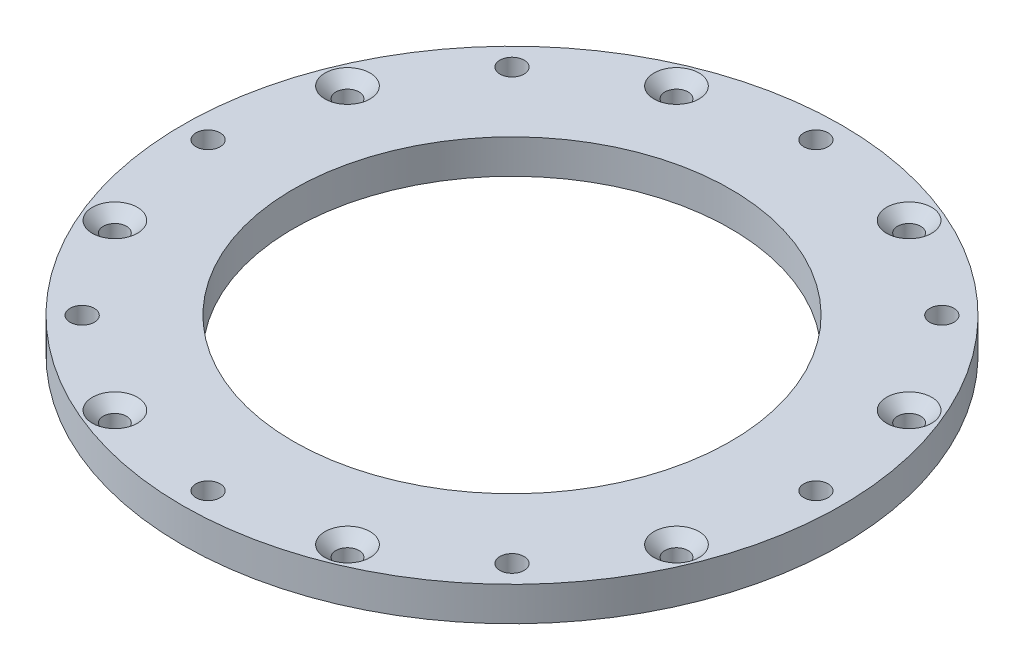
ISO-10303-21;
HEADER;
FILE_DESCRIPTION(('STEP AP214'),'2;1');
FILE_NAME('part.step','',(''),(''),'','','');
FILE_SCHEMA(('AUTOMOTIVE_DESIGN { 1 0 10303 214 1 1 1 1 }'));
ENDSEC;
DATA;
#1=APPLICATION_CONTEXT('core data for automotive mechanical design processes');
#2=APPLICATION_PROTOCOL_DEFINITION('international standard','automotive_design',2000,#1);
#3=PRODUCT_CONTEXT('',#1,'mechanical');
#4=PRODUCT('Part','Part','',(#3));
#5=PRODUCT_RELATED_PRODUCT_CATEGORY('part','',(#4));
#6=PRODUCT_DEFINITION_FORMATION('','',#4);
#7=PRODUCT_DEFINITION_CONTEXT('part definition',#1,'design');
#8=PRODUCT_DEFINITION('design','',#6,#7);
#9=PRODUCT_DEFINITION_SHAPE('','',#8);
#10=(LENGTH_UNIT() NAMED_UNIT(*) SI_UNIT(.MILLI.,.METRE.));
#11=(NAMED_UNIT(*) PLANE_ANGLE_UNIT() SI_UNIT($,.RADIAN.));
#12=(NAMED_UNIT(*) SI_UNIT($,.STERADIAN.) SOLID_ANGLE_UNIT());
#13=UNCERTAINTY_MEASURE_WITH_UNIT(LENGTH_MEASURE(1.E-05),#10,'distance_accuracy_value','');
#14=(GEOMETRIC_REPRESENTATION_CONTEXT(3) GLOBAL_UNCERTAINTY_ASSIGNED_CONTEXT((#13)) GLOBAL_UNIT_ASSIGNED_CONTEXT((#10,
#11,#12)) REPRESENTATION_CONTEXT('',''));
#15=CARTESIAN_POINT('',(0.,0.,0.));
#16=DIRECTION('',(0.,0.,1.));
#17=DIRECTION('',(1.,0.,0.));
#18=AXIS2_PLACEMENT_3D('',#15,#16,#17);
#19=CARTESIAN_POINT('',(0.,5.,0.));
#20=DIRECTION('',(0.,1.,0.));
#21=DIRECTION('',(0.,0.,1.));
#22=AXIS2_PLACEMENT_3D('',#19,#20,#21);
#23=PLANE('',#22);
#24=CARTESIAN_POINT('',(87.9705872597535,5.,-41.1126391967523));
#25=DIRECTION('',(0.,1.,0.));
#26=DIRECTION('',(0.,0.,1.));
#27=AXIS2_PLACEMENT_3D('',#24,#25,#26);
#28=CIRCLE('',#27,3.3);
#29=CARTESIAN_POINT('',(87.9705872597535,5.,-37.8126391967523));
#30=VERTEX_POINT('',#29);
#31=EDGE_CURVE('E224',#30,#30,#28,.T.);
#32=ORIENTED_EDGE('',*,*,#31,.F.);
#33=EDGE_LOOP('',(#32));
#34=FACE_BOUND('',#33,.T.);
#35=CARTESIAN_POINT('',(122.029412740246,5.,-41.1126391967522));
#36=DIRECTION('',(0.,1.,0.));
#37=DIRECTION('',(0.,0.,1.));
#38=AXIS2_PLACEMENT_3D('',#35,#36,#37);
#39=CIRCLE('',#38,3.3);
#40=CARTESIAN_POINT('',(122.029412740246,5.,-37.8126391967523));
#41=VERTEX_POINT('',#40);
#42=EDGE_CURVE('E212',#41,#41,#39,.T.);
#43=ORIENTED_EDGE('',*,*,#42,.F.);
#44=EDGE_LOOP('',(#43));
#45=FACE_BOUND('',#44,.T.);
#46=CARTESIAN_POINT('',(146.112639196752,5.,-17.0294127402465));
#47=DIRECTION('',(0.,1.,0.));
#48=DIRECTION('',(0.,0.,1.));
#49=AXIS2_PLACEMENT_3D('',#46,#47,#48);
#50=CIRCLE('',#49,3.3);
#51=CARTESIAN_POINT('',(146.112639196752,5.,-13.7294127402465));
#52=VERTEX_POINT('',#51);
#53=EDGE_CURVE('E200',#52,#52,#50,.T.);
#54=ORIENTED_EDGE('',*,*,#53,.F.);
#55=EDGE_LOOP('',(#54));
#56=FACE_BOUND('',#55,.T.);
#57=CARTESIAN_POINT('',(146.112639196752,5.,17.0294127402465));
#58=DIRECTION('',(0.,1.,0.));
#59=DIRECTION('',(0.,0.,1.));
#60=AXIS2_PLACEMENT_3D('',#57,#58,#59);
#61=CIRCLE('',#60,3.3);
#62=CARTESIAN_POINT('',(146.112639196752,5.,20.3294127402465));
#63=VERTEX_POINT('',#62);
#64=EDGE_CURVE('E188',#63,#63,#61,.T.);
#65=ORIENTED_EDGE('',*,*,#64,.F.);
#66=EDGE_LOOP('',(#65));
#67=FACE_BOUND('',#66,.T.);
#68=CARTESIAN_POINT('',(122.029412740246,5.,41.1126391967523));
#69=DIRECTION('',(0.,1.,0.));
#70=DIRECTION('',(0.,0.,1.));
#71=AXIS2_PLACEMENT_3D('',#68,#69,#70);
#72=CIRCLE('',#71,3.30000000000001);
#73=CARTESIAN_POINT('',(122.029412740246,5.,44.4126391967523));
#74=VERTEX_POINT('',#73);
#75=EDGE_CURVE('E176',#74,#74,#72,.T.);
#76=ORIENTED_EDGE('',*,*,#75,.F.);
#77=EDGE_LOOP('',(#76));
#78=FACE_BOUND('',#77,.T.);
#79=CARTESIAN_POINT('',(87.9705872597534,5.,41.1126391967523));
#80=DIRECTION('',(0.,1.,0.));
#81=DIRECTION('',(0.,0.,1.));
#82=AXIS2_PLACEMENT_3D('',#79,#80,#81);
#83=CIRCLE('',#82,3.3);
#84=CARTESIAN_POINT('',(87.9705872597534,5.,44.4126391967523));
#85=VERTEX_POINT('',#84);
#86=EDGE_CURVE('E164',#85,#85,#83,.T.);
#87=ORIENTED_EDGE('',*,*,#86,.F.);
#88=EDGE_LOOP('',(#87));
#89=FACE_BOUND('',#88,.T.);
#90=CARTESIAN_POINT('',(63.8873608032477,5.,17.0294127402465));
#91=DIRECTION('',(0.,1.,0.));
#92=DIRECTION('',(0.,0.,1.));
#93=AXIS2_PLACEMENT_3D('',#90,#91,#92);
#94=CIRCLE('',#93,3.3);
#95=CARTESIAN_POINT('',(63.8873608032477,5.,20.3294127402465));
#96=VERTEX_POINT('',#95);
#97=EDGE_CURVE('E152',#96,#96,#94,.T.);
#98=ORIENTED_EDGE('',*,*,#97,.F.);
#99=EDGE_LOOP('',(#98));
#100=FACE_BOUND('',#99,.T.);
#101=CARTESIAN_POINT('',(63.8873608032477,5.,-17.0294127402465));
#102=DIRECTION('',(0.,1.,0.));
#103=DIRECTION('',(0.,0.,1.));
#104=AXIS2_PLACEMENT_3D('',#101,#102,#103);
#105=CIRCLE('',#104,3.3);
#106=CARTESIAN_POINT('',(63.8873608032477,5.,-13.7294127402465));
#107=VERTEX_POINT('',#106);
#108=EDGE_CURVE('E140',#107,#107,#105,.T.);
#109=ORIENTED_EDGE('',*,*,#108,.F.);
#110=EDGE_LOOP('',(#109));
#111=FACE_BOUND('',#110,.T.);
#112=CARTESIAN_POINT('',(105.,5.,-44.5));
#113=DIRECTION('',(0.,1.,0.));
#114=DIRECTION('',(0.,0.,1.));
#115=AXIS2_PLACEMENT_3D('',#112,#113,#114);
#116=CIRCLE('',#115,1.77499999999998);
#117=CARTESIAN_POINT('',(105.,5.,-42.725));
#118=VERTEX_POINT('',#117);
#119=EDGE_CURVE('E73',#118,#118,#116,.T.);
#120=ORIENTED_EDGE('',*,*,#119,.F.);
#121=EDGE_LOOP('',(#120));
#122=FACE_BOUND('',#121,.T.);
#123=CARTESIAN_POINT('',(136.466251762801,5.,-31.4662517628014));
#124=DIRECTION('',(0.,1.,0.));
#125=DIRECTION('',(0.,0.,1.));
#126=AXIS2_PLACEMENT_3D('',#123,#124,#125);
#127=CIRCLE('',#126,1.77499999999999);
#128=CARTESIAN_POINT('',(136.466251762801,5.,-29.6912517628014));
#129=VERTEX_POINT('',#128);
#130=EDGE_CURVE('E98',#129,#129,#127,.T.);
#131=ORIENTED_EDGE('',*,*,#130,.F.);
#132=EDGE_LOOP('',(#131));
#133=FACE_BOUND('',#132,.T.);
#134=CARTESIAN_POINT('',(136.466251762801,5.,31.4662517628014));
#135=DIRECTION('',(0.,1.,0.));
#136=DIRECTION('',(0.,0.,1.));
#137=AXIS2_PLACEMENT_3D('',#134,#135,#136);
#138=CIRCLE('',#137,1.77499999999999);
#139=CARTESIAN_POINT('',(136.466251762801,5.,33.2412517628014));
#140=VERTEX_POINT('',#139);
#141=EDGE_CURVE('E90',#140,#140,#138,.T.);
#142=ORIENTED_EDGE('',*,*,#141,.F.);
#143=EDGE_LOOP('',(#142));
#144=FACE_BOUND('',#143,.T.);
#145=CARTESIAN_POINT('',(73.5337482371986,5.,31.4662517628014));
#146=DIRECTION('',(0.,1.,0.));
#147=DIRECTION('',(0.,0.,1.));
#148=AXIS2_PLACEMENT_3D('',#145,#146,#147);
#149=CIRCLE('',#148,1.77500000000001);
#150=CARTESIAN_POINT('',(73.5337482371986,5.,33.2412517628014));
#151=VERTEX_POINT('',#150);
#152=EDGE_CURVE('E81',#151,#151,#149,.T.);
#153=ORIENTED_EDGE('',*,*,#152,.F.);
#154=EDGE_LOOP('',(#153));
#155=FACE_BOUND('',#154,.T.);
#156=CARTESIAN_POINT('',(60.4999999999999,5.,0.));
#157=DIRECTION('',(0.,1.,0.));
#158=DIRECTION('',(0.,0.,1.));
#159=AXIS2_PLACEMENT_3D('',#156,#157,#158);
#160=CIRCLE('',#159,1.775);
#161=CARTESIAN_POINT('',(60.4999999999999,5.,1.77500000000001));
#162=VERTEX_POINT('',#161);
#163=EDGE_CURVE('E82',#162,#162,#160,.T.);
#164=ORIENTED_EDGE('',*,*,#163,.F.);
#165=EDGE_LOOP('',(#164));
#166=FACE_BOUND('',#165,.T.);
#167=CARTESIAN_POINT('',(149.5,5.,0.));
#168=DIRECTION('',(0.,1.,0.));
#169=DIRECTION('',(0.,0.,1.));
#170=AXIS2_PLACEMENT_3D('',#167,#168,#169);
#171=CIRCLE('',#170,1.775);
#172=CARTESIAN_POINT('',(149.5,5.,1.775));
#173=VERTEX_POINT('',#172);
#174=EDGE_CURVE('E122',#173,#173,#171,.T.);
#175=ORIENTED_EDGE('',*,*,#174,.F.);
#176=EDGE_LOOP('',(#175));
#177=FACE_BOUND('',#176,.T.);
#178=CARTESIAN_POINT('',(105.,5.,44.5));
#179=DIRECTION('',(0.,1.,0.));
#180=DIRECTION('',(0.,0.,1.));
#181=AXIS2_PLACEMENT_3D('',#178,#179,#180);
#182=CIRCLE('',#181,1.77499999999999);
#183=CARTESIAN_POINT('',(105.,5.,46.275));
#184=VERTEX_POINT('',#183);
#185=EDGE_CURVE('E113',#184,#184,#182,.T.);
#186=ORIENTED_EDGE('',*,*,#185,.F.);
#187=EDGE_LOOP('',(#186));
#188=FACE_BOUND('',#187,.T.);
#189=CARTESIAN_POINT('',(73.5337482371986,5.,-31.4662517628014));
#190=DIRECTION('',(0.,1.,0.));
#191=DIRECTION('',(0.,0.,1.));
#192=AXIS2_PLACEMENT_3D('',#189,#190,#191);
#193=CIRCLE('',#192,1.77499999999999);
#194=CARTESIAN_POINT('',(73.5337482371986,5.,-29.6912517628014));
#195=VERTEX_POINT('',#194);
#196=EDGE_CURVE('E69',#195,#195,#193,.T.);
#197=ORIENTED_EDGE('',*,*,#196,.F.);
#198=EDGE_LOOP('',(#197));
#199=FACE_BOUND('',#198,.T.);
#200=CARTESIAN_POINT('',(105.,5.,0.));
#201=DIRECTION('',(0.,1.,0.));
#202=DIRECTION('',(0.,0.,1.));
#203=AXIS2_PLACEMENT_3D('',#200,#201,#202);
#204=CIRCLE('',#203,32.);
#205=CARTESIAN_POINT('',(105.,5.,32.));
#206=VERTEX_POINT('',#205);
#207=EDGE_CURVE('E62',#206,#206,#204,.T.);
#208=ORIENTED_EDGE('',*,*,#207,.F.);
#209=EDGE_LOOP('',(#208));
#210=FACE_BOUND('',#209,.T.);
#211=CARTESIAN_POINT('',(105.,5.,0.));
#212=DIRECTION('',(0.,1.,0.));
#213=DIRECTION('',(0.,0.,1.));
#214=AXIS2_PLACEMENT_3D('',#211,#212,#213);
#215=CIRCLE('',#214,48.25);
#216=CARTESIAN_POINT('',(105.,5.,48.25));
#217=VERTEX_POINT('',#216);
#218=EDGE_CURVE('E52',#217,#217,#215,.T.);
#219=ORIENTED_EDGE('',*,*,#218,.T.);
#220=EDGE_LOOP('',(#219));
#221=FACE_BOUND('',#220,.T.);
#222=ADVANCED_FACE('F44',(#34,#45,#56,#67,#78,#89,#100,#111,#122,#133,#144,#155,#166,#177,#188,
#199,#210,#221),#23,.T.);
#223=CARTESIAN_POINT('',(0.,0.,0.));
#224=DIRECTION('',(0.,1.,0.));
#225=DIRECTION('',(0.,0.,1.));
#226=AXIS2_PLACEMENT_3D('',#223,#224,#225);
#227=PLANE('',#226);
#228=CARTESIAN_POINT('',(87.9705872597535,0.,-41.1126391967523));
#229=DIRECTION('',(0.,1.,0.));
#230=DIRECTION('',(0.,0.,1.));
#231=AXIS2_PLACEMENT_3D('',#228,#229,#230);
#232=CIRCLE('',#231,1.69999999999999);
#233=CARTESIAN_POINT('',(87.9705872597535,0.,-39.4126391967523));
#234=VERTEX_POINT('',#233);
#235=EDGE_CURVE('E216',#234,#234,#232,.T.);
#236=ORIENTED_EDGE('',*,*,#235,.T.);
#237=EDGE_LOOP('',(#236));
#238=FACE_BOUND('',#237,.T.);
#239=CARTESIAN_POINT('',(122.029412740246,0.,-41.1126391967522));
#240=DIRECTION('',(0.,1.,0.));
#241=DIRECTION('',(0.,0.,1.));
#242=AXIS2_PLACEMENT_3D('',#239,#240,#241);
#243=CIRCLE('',#242,1.69999999999999);
#244=CARTESIAN_POINT('',(122.029412740246,0.,-39.4126391967523));
#245=VERTEX_POINT('',#244);
#246=EDGE_CURVE('E204',#245,#245,#243,.T.);
#247=ORIENTED_EDGE('',*,*,#246,.T.);
#248=EDGE_LOOP('',(#247));
#249=FACE_BOUND('',#248,.T.);
#250=CARTESIAN_POINT('',(146.112639196752,0.,-17.0294127402465));
#251=DIRECTION('',(0.,1.,0.));
#252=DIRECTION('',(0.,0.,1.));
#253=AXIS2_PLACEMENT_3D('',#250,#251,#252);
#254=CIRCLE('',#253,1.69999999999998);
#255=CARTESIAN_POINT('',(146.112639196752,0.,-15.3294127402465));
#256=VERTEX_POINT('',#255);
#257=EDGE_CURVE('E192',#256,#256,#254,.T.);
#258=ORIENTED_EDGE('',*,*,#257,.T.);
#259=EDGE_LOOP('',(#258));
#260=FACE_BOUND('',#259,.T.);
#261=CARTESIAN_POINT('',(146.112639196752,0.,17.0294127402465));
#262=DIRECTION('',(0.,1.,0.));
#263=DIRECTION('',(0.,0.,1.));
#264=AXIS2_PLACEMENT_3D('',#261,#262,#263);
#265=CIRCLE('',#264,1.69999999999998);
#266=CARTESIAN_POINT('',(146.112639196752,0.,18.7294127402465));
#267=VERTEX_POINT('',#266);
#268=EDGE_CURVE('E180',#267,#267,#265,.T.);
#269=ORIENTED_EDGE('',*,*,#268,.T.);
#270=EDGE_LOOP('',(#269));
#271=FACE_BOUND('',#270,.T.);
#272=CARTESIAN_POINT('',(122.029412740246,0.,41.1126391967523));
#273=DIRECTION('',(0.,1.,0.));
#274=DIRECTION('',(0.,0.,1.));
#275=AXIS2_PLACEMENT_3D('',#272,#273,#274);
#276=CIRCLE('',#275,1.69999999999999);
#277=CARTESIAN_POINT('',(122.029412740246,0.,42.8126391967523));
#278=VERTEX_POINT('',#277);
#279=EDGE_CURVE('E168',#278,#278,#276,.T.);
#280=ORIENTED_EDGE('',*,*,#279,.T.);
#281=EDGE_LOOP('',(#280));
#282=FACE_BOUND('',#281,.T.);
#283=CARTESIAN_POINT('',(87.9705872597534,0.,41.1126391967523));
#284=DIRECTION('',(0.,1.,0.));
#285=DIRECTION('',(0.,0.,1.));
#286=AXIS2_PLACEMENT_3D('',#283,#284,#285);
#287=CIRCLE('',#286,1.69999999999999);
#288=CARTESIAN_POINT('',(87.9705872597534,0.,42.8126391967522));
#289=VERTEX_POINT('',#288);
#290=EDGE_CURVE('E156',#289,#289,#287,.T.);
#291=ORIENTED_EDGE('',*,*,#290,.T.);
#292=EDGE_LOOP('',(#291));
#293=FACE_BOUND('',#292,.T.);
#294=CARTESIAN_POINT('',(63.8873608032477,0.,17.0294127402465));
#295=DIRECTION('',(0.,1.,0.));
#296=DIRECTION('',(0.,0.,1.));
#297=AXIS2_PLACEMENT_3D('',#294,#295,#296);
#298=CIRCLE('',#297,1.69999999999999);
#299=CARTESIAN_POINT('',(63.8873608032477,0.,18.7294127402465));
#300=VERTEX_POINT('',#299);
#301=EDGE_CURVE('E144',#300,#300,#298,.T.);
#302=ORIENTED_EDGE('',*,*,#301,.T.);
#303=EDGE_LOOP('',(#302));
#304=FACE_BOUND('',#303,.T.);
#305=CARTESIAN_POINT('',(63.8873608032477,0.,-17.0294127402465));
#306=DIRECTION('',(0.,1.,0.));
#307=DIRECTION('',(0.,0.,1.));
#308=AXIS2_PLACEMENT_3D('',#305,#306,#307);
#309=CIRCLE('',#308,1.69999999999999);
#310=CARTESIAN_POINT('',(63.8873608032477,0.,-15.3294127402465));
#311=VERTEX_POINT('',#310);
#312=EDGE_CURVE('E114',#311,#311,#309,.T.);
#313=ORIENTED_EDGE('',*,*,#312,.T.);
#314=EDGE_LOOP('',(#313));
#315=FACE_BOUND('',#314,.T.);
#316=CARTESIAN_POINT('',(105.,0.,-44.5));
#317=DIRECTION('',(0.,1.,0.));
#318=DIRECTION('',(0.,0.,1.));
#319=AXIS2_PLACEMENT_3D('',#316,#317,#318);
#320=CIRCLE('',#319,1.77499999999998);
#321=CARTESIAN_POINT('',(105.,0.,-42.725));
#322=VERTEX_POINT('',#321);
#323=EDGE_CURVE('E102',#322,#322,#320,.T.);
#324=ORIENTED_EDGE('',*,*,#323,.T.);
#325=EDGE_LOOP('',(#324));
#326=FACE_BOUND('',#325,.T.);
#327=CARTESIAN_POINT('',(136.466251762801,0.,-31.4662517628014));
#328=DIRECTION('',(0.,1.,0.));
#329=DIRECTION('',(0.,0.,1.));
#330=AXIS2_PLACEMENT_3D('',#327,#328,#329);
#331=CIRCLE('',#330,1.77499999999999);
#332=CARTESIAN_POINT('',(136.466251762801,0.,-29.6912517628014));
#333=VERTEX_POINT('',#332);
#334=EDGE_CURVE('E94',#333,#333,#331,.T.);
#335=ORIENTED_EDGE('',*,*,#334,.T.);
#336=EDGE_LOOP('',(#335));
#337=FACE_BOUND('',#336,.T.);
#338=CARTESIAN_POINT('',(136.466251762801,0.,31.4662517628014));
#339=DIRECTION('',(0.,1.,0.));
#340=DIRECTION('',(0.,0.,1.));
#341=AXIS2_PLACEMENT_3D('',#338,#339,#340);
#342=CIRCLE('',#341,1.77499999999999);
#343=CARTESIAN_POINT('',(136.466251762801,0.,33.2412517628014));
#344=VERTEX_POINT('',#343);
#345=EDGE_CURVE('E86',#344,#344,#342,.T.);
#346=ORIENTED_EDGE('',*,*,#345,.T.);
#347=EDGE_LOOP('',(#346));
#348=FACE_BOUND('',#347,.T.);
#349=CARTESIAN_POINT('',(73.5337482371986,0.,31.4662517628014));
#350=DIRECTION('',(0.,1.,0.));
#351=DIRECTION('',(0.,0.,1.));
#352=AXIS2_PLACEMENT_3D('',#349,#350,#351);
#353=CIRCLE('',#352,1.77500000000001);
#354=CARTESIAN_POINT('',(73.5337482371986,0.,33.2412517628014));
#355=VERTEX_POINT('',#354);
#356=EDGE_CURVE('E77',#355,#355,#353,.T.);
#357=ORIENTED_EDGE('',*,*,#356,.T.);
#358=EDGE_LOOP('',(#357));
#359=FACE_BOUND('',#358,.T.);
#360=CARTESIAN_POINT('',(60.4999999999999,0.,0.));
#361=DIRECTION('',(0.,1.,0.));
#362=DIRECTION('',(0.,0.,1.));
#363=AXIS2_PLACEMENT_3D('',#360,#361,#362);
#364=CIRCLE('',#363,1.775);
#365=CARTESIAN_POINT('',(60.4999999999999,0.,1.77500000000001));
#366=VERTEX_POINT('',#365);
#367=EDGE_CURVE('E126',#366,#366,#364,.T.);
#368=ORIENTED_EDGE('',*,*,#367,.T.);
#369=EDGE_LOOP('',(#368));
#370=FACE_BOUND('',#369,.T.);
#371=CARTESIAN_POINT('',(149.5,0.,0.));
#372=DIRECTION('',(0.,1.,0.));
#373=DIRECTION('',(0.,0.,1.));
#374=AXIS2_PLACEMENT_3D('',#371,#372,#373);
#375=CIRCLE('',#374,1.775);
#376=CARTESIAN_POINT('',(149.5,0.,1.775));
#377=VERTEX_POINT('',#376);
#378=EDGE_CURVE('E118',#377,#377,#375,.T.);
#379=ORIENTED_EDGE('',*,*,#378,.T.);
#380=EDGE_LOOP('',(#379));
#381=FACE_BOUND('',#380,.T.);
#382=CARTESIAN_POINT('',(105.,0.,44.5));
#383=DIRECTION('',(0.,1.,0.));
#384=DIRECTION('',(0.,0.,1.));
#385=AXIS2_PLACEMENT_3D('',#382,#383,#384);
#386=CIRCLE('',#385,1.77499999999999);
#387=CARTESIAN_POINT('',(105.,0.,46.275));
#388=VERTEX_POINT('',#387);
#389=EDGE_CURVE('E109',#388,#388,#386,.T.);
#390=ORIENTED_EDGE('',*,*,#389,.T.);
#391=EDGE_LOOP('',(#390));
#392=FACE_BOUND('',#391,.T.);
#393=CARTESIAN_POINT('',(73.5337482371986,0.,-31.4662517628014));
#394=DIRECTION('',(0.,1.,0.));
#395=DIRECTION('',(0.,0.,1.));
#396=AXIS2_PLACEMENT_3D('',#393,#394,#395);
#397=CIRCLE('',#396,1.77499999999999);
#398=CARTESIAN_POINT('',(73.5337482371986,0.,-29.6912517628014));
#399=VERTEX_POINT('',#398);
#400=EDGE_CURVE('E67',#399,#399,#397,.T.);
#401=ORIENTED_EDGE('',*,*,#400,.T.);
#402=EDGE_LOOP('',(#401));
#403=FACE_BOUND('',#402,.T.);
#404=CARTESIAN_POINT('',(105.,0.,0.));
#405=DIRECTION('',(0.,1.,0.));
#406=DIRECTION('',(0.,0.,1.));
#407=AXIS2_PLACEMENT_3D('',#404,#405,#406);
#408=CIRCLE('',#407,32.);
#409=CARTESIAN_POINT('',(105.,0.,32.));
#410=VERTEX_POINT('',#409);
#411=EDGE_CURVE('E57',#410,#410,#408,.T.);
#412=ORIENTED_EDGE('',*,*,#411,.T.);
#413=EDGE_LOOP('',(#412));
#414=FACE_BOUND('',#413,.T.);
#415=CARTESIAN_POINT('',(105.,0.,0.));
#416=DIRECTION('',(0.,1.,0.));
#417=DIRECTION('',(0.,0.,1.));
#418=AXIS2_PLACEMENT_3D('',#415,#416,#417);
#419=CIRCLE('',#418,48.25);
#420=CARTESIAN_POINT('',(105.,0.,48.25));
#421=VERTEX_POINT('',#420);
#422=EDGE_CURVE('E10',#421,#421,#419,.F.);
#423=ORIENTED_EDGE('',*,*,#422,.T.);
#424=EDGE_LOOP('',(#423));
#425=FACE_BOUND('',#424,.T.);
#426=ADVANCED_FACE('F46',(#238,#249,#260,#271,#282,#293,#304,#315,#326,#337,#348,#359,#370,#381,
#392,#403,#414,#425),#227,.F.);
#427=CARTESIAN_POINT('',(105.,-136.471608769004,0.));
#428=DIRECTION('',(0.,1.,0.));
#429=DIRECTION('',(0.,0.,1.));
#430=AXIS2_PLACEMENT_3D('',#427,#428,#429);
#431=CYLINDRICAL_SURFACE('',#430,48.25);
#432=ORIENTED_EDGE('',*,*,#218,.F.);
#433=EDGE_LOOP('',(#432));
#434=FACE_BOUND('',#433,.T.);
#435=ORIENTED_EDGE('',*,*,#422,.F.);
#436=EDGE_LOOP('',(#435));
#437=FACE_BOUND('',#436,.T.);
#438=ADVANCED_FACE('F268',(#434,#437),#431,.T.);
#439=CARTESIAN_POINT('',(105.,0.,0.));
#440=DIRECTION('',(0.,1.,0.));
#441=DIRECTION('',(0.,0.,1.));
#442=AXIS2_PLACEMENT_3D('',#439,#440,#441);
#443=CYLINDRICAL_SURFACE('',#442,32.);
#444=ORIENTED_EDGE('',*,*,#411,.F.);
#445=EDGE_LOOP('',(#444));
#446=FACE_BOUND('',#445,.T.);
#447=ORIENTED_EDGE('',*,*,#207,.T.);
#448=EDGE_LOOP('',(#447));
#449=FACE_BOUND('',#448,.T.);
#450=ADVANCED_FACE('F265',(#446,#449),#443,.F.);
#451=CARTESIAN_POINT('',(73.5337482371986,0.,-31.4662517628014));
#452=DIRECTION('',(0.,1.,0.));
#453=DIRECTION('',(0.,0.,1.));
#454=AXIS2_PLACEMENT_3D('',#451,#452,#453);
#455=CYLINDRICAL_SURFACE('',#454,1.77499999999999);
#456=ORIENTED_EDGE('',*,*,#400,.F.);
#457=EDGE_LOOP('',(#456));
#458=FACE_BOUND('',#457,.T.);
#459=ORIENTED_EDGE('',*,*,#196,.T.);
#460=EDGE_LOOP('',(#459));
#461=FACE_BOUND('',#460,.T.);
#462=ADVANCED_FACE('F267',(#458,#461),#455,.F.);
#463=CARTESIAN_POINT('',(105.,0.,44.5));
#464=DIRECTION('',(0.,1.,0.));
#465=DIRECTION('',(0.,0.,1.));
#466=AXIS2_PLACEMENT_3D('',#463,#464,#465);
#467=CYLINDRICAL_SURFACE('',#466,1.77499999999999);
#468=ORIENTED_EDGE('',*,*,#389,.F.);
#469=EDGE_LOOP('',(#468));
#470=FACE_BOUND('',#469,.T.);
#471=ORIENTED_EDGE('',*,*,#185,.T.);
#472=EDGE_LOOP('',(#471));
#473=FACE_BOUND('',#472,.T.);
#474=ADVANCED_FACE('F275',(#470,#473),#467,.F.);
#475=CARTESIAN_POINT('',(149.5,0.,0.));
#476=DIRECTION('',(0.,1.,0.));
#477=DIRECTION('',(0.,0.,1.));
#478=AXIS2_PLACEMENT_3D('',#475,#476,#477);
#479=CYLINDRICAL_SURFACE('',#478,1.775);
#480=ORIENTED_EDGE('',*,*,#378,.F.);
#481=EDGE_LOOP('',(#480));
#482=FACE_BOUND('',#481,.T.);
#483=ORIENTED_EDGE('',*,*,#174,.T.);
#484=EDGE_LOOP('',(#483));
#485=FACE_BOUND('',#484,.T.);
#486=ADVANCED_FACE('F302',(#482,#485),#479,.F.);
#487=CARTESIAN_POINT('',(60.4999999999999,0.,0.));
#488=DIRECTION('',(0.,1.,0.));
#489=DIRECTION('',(0.,0.,1.));
#490=AXIS2_PLACEMENT_3D('',#487,#488,#489);
#491=CYLINDRICAL_SURFACE('',#490,1.775);
#492=ORIENTED_EDGE('',*,*,#367,.F.);
#493=EDGE_LOOP('',(#492));
#494=FACE_BOUND('',#493,.T.);
#495=ORIENTED_EDGE('',*,*,#163,.T.);
#496=EDGE_LOOP('',(#495));
#497=FACE_BOUND('',#496,.T.);
#498=ADVANCED_FACE('F286',(#494,#497),#491,.F.);
#499=CARTESIAN_POINT('',(73.5337482371986,0.,31.4662517628014));
#500=DIRECTION('',(0.,1.,0.));
#501=DIRECTION('',(0.,0.,1.));
#502=AXIS2_PLACEMENT_3D('',#499,#500,#501);
#503=CYLINDRICAL_SURFACE('',#502,1.77500000000001);
#504=ORIENTED_EDGE('',*,*,#356,.F.);
#505=EDGE_LOOP('',(#504));
#506=FACE_BOUND('',#505,.T.);
#507=ORIENTED_EDGE('',*,*,#152,.T.);
#508=EDGE_LOOP('',(#507));
#509=FACE_BOUND('',#508,.T.);
#510=ADVANCED_FACE('F282',(#506,#509),#503,.F.);
#511=CARTESIAN_POINT('',(136.466251762801,0.,31.4662517628014));
#512=DIRECTION('',(0.,1.,0.));
#513=DIRECTION('',(0.,0.,1.));
#514=AXIS2_PLACEMENT_3D('',#511,#512,#513);
#515=CYLINDRICAL_SURFACE('',#514,1.77499999999999);
#516=ORIENTED_EDGE('',*,*,#345,.F.);
#517=EDGE_LOOP('',(#516));
#518=FACE_BOUND('',#517,.T.);
#519=ORIENTED_EDGE('',*,*,#141,.T.);
#520=EDGE_LOOP('',(#519));
#521=FACE_BOUND('',#520,.T.);
#522=ADVANCED_FACE('F285',(#518,#521),#515,.F.);
#523=CARTESIAN_POINT('',(136.466251762801,0.,-31.4662517628014));
#524=DIRECTION('',(0.,1.,0.));
#525=DIRECTION('',(0.,0.,1.));
#526=AXIS2_PLACEMENT_3D('',#523,#524,#525);
#527=CYLINDRICAL_SURFACE('',#526,1.77499999999999);
#528=ORIENTED_EDGE('',*,*,#334,.F.);
#529=EDGE_LOOP('',(#528));
#530=FACE_BOUND('',#529,.T.);
#531=ORIENTED_EDGE('',*,*,#130,.T.);
#532=EDGE_LOOP('',(#531));
#533=FACE_BOUND('',#532,.T.);
#534=ADVANCED_FACE('F290',(#530,#533),#527,.F.);
#535=CARTESIAN_POINT('',(105.,0.,-44.5));
#536=DIRECTION('',(0.,1.,0.));
#537=DIRECTION('',(0.,0.,1.));
#538=AXIS2_PLACEMENT_3D('',#535,#536,#537);
#539=CYLINDRICAL_SURFACE('',#538,1.77499999999998);
#540=ORIENTED_EDGE('',*,*,#323,.F.);
#541=EDGE_LOOP('',(#540));
#542=FACE_BOUND('',#541,.T.);
#543=ORIENTED_EDGE('',*,*,#119,.T.);
#544=EDGE_LOOP('',(#543));
#545=FACE_BOUND('',#544,.T.);
#546=ADVANCED_FACE('F294',(#542,#545),#539,.F.);
#547=CARTESIAN_POINT('',(63.8873608032477,5.,-17.0294127402465));
#548=DIRECTION('',(0.,1.,0.));
#549=DIRECTION('',(0.,0.,1.));
#550=AXIS2_PLACEMENT_3D('',#547,#548,#549);
#551=CYLINDRICAL_SURFACE('',#550,1.69999999999999);
#552=ORIENTED_EDGE('',*,*,#312,.F.);
#553=EDGE_LOOP('',(#552));
#554=FACE_BOUND('',#553,.T.);
#555=CARTESIAN_POINT('',(63.8873608032477,3.4,-17.0294127402465));
#556=DIRECTION('',(0.,1.,0.));
#557=DIRECTION('',(0.,0.,1.));
#558=AXIS2_PLACEMENT_3D('',#555,#556,#557);
#559=CIRCLE('',#558,1.69999999999999);
#560=CARTESIAN_POINT('',(63.8873608032477,3.4,-15.3294127402465));
#561=VERTEX_POINT('',#560);
#562=EDGE_CURVE('E136',#561,#561,#559,.T.);
#563=ORIENTED_EDGE('',*,*,#562,.T.);
#564=EDGE_LOOP('',(#563));
#565=FACE_BOUND('',#564,.T.);
#566=ADVANCED_FACE('F298',(#554,#565),#551,.F.);
#567=CARTESIAN_POINT('',(63.8873608032477,5.,-17.0294127402465));
#568=DIRECTION('',(0.,1.,0.));
#569=DIRECTION('',(0.,0.,1.));
#570=AXIS2_PLACEMENT_3D('',#567,#568,#569);
#571=CONICAL_SURFACE('',#570,3.3,0.785398163397448);
#572=ORIENTED_EDGE('',*,*,#562,.F.);
#573=EDGE_LOOP('',(#572));
#574=FACE_BOUND('',#573,.T.);
#575=ORIENTED_EDGE('',*,*,#108,.T.);
#576=EDGE_LOOP('',(#575));
#577=FACE_BOUND('',#576,.T.);
#578=ADVANCED_FACE('F312',(#574,#577),#571,.F.);
#579=CARTESIAN_POINT('',(63.8873608032477,5.,17.0294127402465));
#580=DIRECTION('',(0.,1.,0.));
#581=DIRECTION('',(0.,0.,1.));
#582=AXIS2_PLACEMENT_3D('',#579,#580,#581);
#583=CYLINDRICAL_SURFACE('',#582,1.69999999999999);
#584=ORIENTED_EDGE('',*,*,#301,.F.);
#585=EDGE_LOOP('',(#584));
#586=FACE_BOUND('',#585,.T.);
#587=CARTESIAN_POINT('',(63.8873608032477,3.4,17.0294127402465));
#588=DIRECTION('',(0.,1.,0.));
#589=DIRECTION('',(0.,0.,1.));
#590=AXIS2_PLACEMENT_3D('',#587,#588,#589);
#591=CIRCLE('',#590,1.69999999999999);
#592=CARTESIAN_POINT('',(63.8873608032477,3.4,18.7294127402465));
#593=VERTEX_POINT('',#592);
#594=EDGE_CURVE('E148',#593,#593,#591,.T.);
#595=ORIENTED_EDGE('',*,*,#594,.T.);
#596=EDGE_LOOP('',(#595));
#597=FACE_BOUND('',#596,.T.);
#598=ADVANCED_FACE('F316',(#586,#597),#583,.F.);
#599=CARTESIAN_POINT('',(63.8873608032477,5.,17.0294127402465));
#600=DIRECTION('',(0.,1.,0.));
#601=DIRECTION('',(0.,0.,1.));
#602=AXIS2_PLACEMENT_3D('',#599,#600,#601);
#603=CONICAL_SURFACE('',#602,3.3,0.785398163397448);
#604=ORIENTED_EDGE('',*,*,#594,.F.);
#605=EDGE_LOOP('',(#604));
#606=FACE_BOUND('',#605,.T.);
#607=ORIENTED_EDGE('',*,*,#97,.T.);
#608=EDGE_LOOP('',(#607));
#609=FACE_BOUND('',#608,.T.);
#610=ADVANCED_FACE('F320',(#606,#609),#603,.F.);
#611=CARTESIAN_POINT('',(87.9705872597534,5.,41.1126391967523));
#612=DIRECTION('',(0.,1.,0.));
#613=DIRECTION('',(0.,0.,1.));
#614=AXIS2_PLACEMENT_3D('',#611,#612,#613);
#615=CYLINDRICAL_SURFACE('',#614,1.69999999999999);
#616=ORIENTED_EDGE('',*,*,#290,.F.);
#617=EDGE_LOOP('',(#616));
#618=FACE_BOUND('',#617,.T.);
#619=CARTESIAN_POINT('',(87.9705872597534,3.4,41.1126391967523));
#620=DIRECTION('',(0.,1.,0.));
#621=DIRECTION('',(0.,0.,1.));
#622=AXIS2_PLACEMENT_3D('',#619,#620,#621);
#623=CIRCLE('',#622,1.69999999999999);
#624=CARTESIAN_POINT('',(87.9705872597534,3.4,42.8126391967522));
#625=VERTEX_POINT('',#624);
#626=EDGE_CURVE('E160',#625,#625,#623,.T.);
#627=ORIENTED_EDGE('',*,*,#626,.T.);
#628=EDGE_LOOP('',(#627));
#629=FACE_BOUND('',#628,.T.);
#630=ADVANCED_FACE('F324',(#618,#629),#615,.F.);
#631=CARTESIAN_POINT('',(87.9705872597534,5.,41.1126391967523));
#632=DIRECTION('',(0.,1.,0.));
#633=DIRECTION('',(0.,0.,1.));
#634=AXIS2_PLACEMENT_3D('',#631,#632,#633);
#635=CONICAL_SURFACE('',#634,3.3,0.785398163397448);
#636=ORIENTED_EDGE('',*,*,#626,.F.);
#637=EDGE_LOOP('',(#636));
#638=FACE_BOUND('',#637,.T.);
#639=ORIENTED_EDGE('',*,*,#86,.T.);
#640=EDGE_LOOP('',(#639));
#641=FACE_BOUND('',#640,.T.);
#642=ADVANCED_FACE('F328',(#638,#641),#635,.F.);
#643=CARTESIAN_POINT('',(122.029412740246,5.,41.1126391967523));
#644=DIRECTION('',(0.,1.,0.));
#645=DIRECTION('',(0.,0.,1.));
#646=AXIS2_PLACEMENT_3D('',#643,#644,#645);
#647=CYLINDRICAL_SURFACE('',#646,1.69999999999999);
#648=ORIENTED_EDGE('',*,*,#279,.F.);
#649=EDGE_LOOP('',(#648));
#650=FACE_BOUND('',#649,.T.);
#651=CARTESIAN_POINT('',(122.029412740246,3.4,41.1126391967523));
#652=DIRECTION('',(0.,1.,0.));
#653=DIRECTION('',(0.,0.,1.));
#654=AXIS2_PLACEMENT_3D('',#651,#652,#653);
#655=CIRCLE('',#654,1.69999999999999);
#656=CARTESIAN_POINT('',(122.029412740246,3.4,42.8126391967523));
#657=VERTEX_POINT('',#656);
#658=EDGE_CURVE('E172',#657,#657,#655,.T.);
#659=ORIENTED_EDGE('',*,*,#658,.T.);
#660=EDGE_LOOP('',(#659));
#661=FACE_BOUND('',#660,.T.);
#662=ADVANCED_FACE('F332',(#650,#661),#647,.F.);
#663=CARTESIAN_POINT('',(122.029412740246,5.,41.1126391967523));
#664=DIRECTION('',(0.,1.,0.));
#665=DIRECTION('',(0.,0.,1.));
#666=AXIS2_PLACEMENT_3D('',#663,#664,#665);
#667=CONICAL_SURFACE('',#666,3.30000000000001,0.785398163397452);
#668=ORIENTED_EDGE('',*,*,#658,.F.);
#669=EDGE_LOOP('',(#668));
#670=FACE_BOUND('',#669,.T.);
#671=ORIENTED_EDGE('',*,*,#75,.T.);
#672=EDGE_LOOP('',(#671));
#673=FACE_BOUND('',#672,.T.);
#674=ADVANCED_FACE('F336',(#670,#673),#667,.F.);
#675=CARTESIAN_POINT('',(146.112639196752,5.,17.0294127402465));
#676=DIRECTION('',(0.,1.,0.));
#677=DIRECTION('',(0.,0.,1.));
#678=AXIS2_PLACEMENT_3D('',#675,#676,#677);
#679=CYLINDRICAL_SURFACE('',#678,1.69999999999998);
#680=ORIENTED_EDGE('',*,*,#268,.F.);
#681=EDGE_LOOP('',(#680));
#682=FACE_BOUND('',#681,.T.);
#683=CARTESIAN_POINT('',(146.112639196752,3.4,17.0294127402465));
#684=DIRECTION('',(0.,1.,0.));
#685=DIRECTION('',(0.,0.,1.));
#686=AXIS2_PLACEMENT_3D('',#683,#684,#685);
#687=CIRCLE('',#686,1.69999999999998);
#688=CARTESIAN_POINT('',(146.112639196752,3.4,18.7294127402465));
#689=VERTEX_POINT('',#688);
#690=EDGE_CURVE('E184',#689,#689,#687,.T.);
#691=ORIENTED_EDGE('',*,*,#690,.T.);
#692=EDGE_LOOP('',(#691));
#693=FACE_BOUND('',#692,.T.);
#694=ADVANCED_FACE('F340',(#682,#693),#679,.F.);
#695=CARTESIAN_POINT('',(146.112639196752,5.,17.0294127402465));
#696=DIRECTION('',(0.,1.,0.));
#697=DIRECTION('',(0.,0.,1.));
#698=AXIS2_PLACEMENT_3D('',#695,#696,#697);
#699=CONICAL_SURFACE('',#698,3.3,0.785398163397452);
#700=ORIENTED_EDGE('',*,*,#690,.F.);
#701=EDGE_LOOP('',(#700));
#702=FACE_BOUND('',#701,.T.);
#703=ORIENTED_EDGE('',*,*,#64,.T.);
#704=EDGE_LOOP('',(#703));
#705=FACE_BOUND('',#704,.T.);
#706=ADVANCED_FACE('F344',(#702,#705),#699,.F.);
#707=CARTESIAN_POINT('',(146.112639196752,5.,-17.0294127402465));
#708=DIRECTION('',(0.,1.,0.));
#709=DIRECTION('',(0.,0.,1.));
#710=AXIS2_PLACEMENT_3D('',#707,#708,#709);
#711=CYLINDRICAL_SURFACE('',#710,1.69999999999998);
#712=ORIENTED_EDGE('',*,*,#257,.F.);
#713=EDGE_LOOP('',(#712));
#714=FACE_BOUND('',#713,.T.);
#715=CARTESIAN_POINT('',(146.112639196752,3.4,-17.0294127402465));
#716=DIRECTION('',(0.,1.,0.));
#717=DIRECTION('',(0.,0.,1.));
#718=AXIS2_PLACEMENT_3D('',#715,#716,#717);
#719=CIRCLE('',#718,1.69999999999998);
#720=CARTESIAN_POINT('',(146.112639196752,3.4,-15.3294127402465));
#721=VERTEX_POINT('',#720);
#722=EDGE_CURVE('E196',#721,#721,#719,.T.);
#723=ORIENTED_EDGE('',*,*,#722,.T.);
#724=EDGE_LOOP('',(#723));
#725=FACE_BOUND('',#724,.T.);
#726=ADVANCED_FACE('F348',(#714,#725),#711,.F.);
#727=CARTESIAN_POINT('',(146.112639196752,5.,-17.0294127402465));
#728=DIRECTION('',(0.,1.,0.));
#729=DIRECTION('',(0.,0.,1.));
#730=AXIS2_PLACEMENT_3D('',#727,#728,#729);
#731=CONICAL_SURFACE('',#730,3.3,0.785398163397452);
#732=ORIENTED_EDGE('',*,*,#722,.F.);
#733=EDGE_LOOP('',(#732));
#734=FACE_BOUND('',#733,.T.);
#735=ORIENTED_EDGE('',*,*,#53,.T.);
#736=EDGE_LOOP('',(#735));
#737=FACE_BOUND('',#736,.T.);
#738=ADVANCED_FACE('F352',(#734,#737),#731,.F.);
#739=CARTESIAN_POINT('',(122.029412740246,5.,-41.1126391967522));
#740=DIRECTION('',(0.,1.,0.));
#741=DIRECTION('',(0.,0.,1.));
#742=AXIS2_PLACEMENT_3D('',#739,#740,#741);
#743=CYLINDRICAL_SURFACE('',#742,1.69999999999999);
#744=ORIENTED_EDGE('',*,*,#246,.F.);
#745=EDGE_LOOP('',(#744));
#746=FACE_BOUND('',#745,.T.);
#747=CARTESIAN_POINT('',(122.029412740246,3.4,-41.1126391967522));
#748=DIRECTION('',(0.,1.,0.));
#749=DIRECTION('',(0.,0.,1.));
#750=AXIS2_PLACEMENT_3D('',#747,#748,#749);
#751=CIRCLE('',#750,1.69999999999999);
#752=CARTESIAN_POINT('',(122.029412740246,3.4,-39.4126391967523));
#753=VERTEX_POINT('',#752);
#754=EDGE_CURVE('E208',#753,#753,#751,.T.);
#755=ORIENTED_EDGE('',*,*,#754,.T.);
#756=EDGE_LOOP('',(#755));
#757=FACE_BOUND('',#756,.T.);
#758=ADVANCED_FACE('F356',(#746,#757),#743,.F.);
#759=CARTESIAN_POINT('',(122.029412740246,5.,-41.1126391967522));
#760=DIRECTION('',(0.,1.,0.));
#761=DIRECTION('',(0.,0.,1.));
#762=AXIS2_PLACEMENT_3D('',#759,#760,#761);
#763=CONICAL_SURFACE('',#762,3.3,0.785398163397448);
#764=ORIENTED_EDGE('',*,*,#754,.F.);
#765=EDGE_LOOP('',(#764));
#766=FACE_BOUND('',#765,.T.);
#767=ORIENTED_EDGE('',*,*,#42,.T.);
#768=EDGE_LOOP('',(#767));
#769=FACE_BOUND('',#768,.T.);
#770=ADVANCED_FACE('F360',(#766,#769),#763,.F.);
#771=CARTESIAN_POINT('',(87.9705872597535,5.,-41.1126391967523));
#772=DIRECTION('',(0.,1.,0.));
#773=DIRECTION('',(0.,0.,1.));
#774=AXIS2_PLACEMENT_3D('',#771,#772,#773);
#775=CYLINDRICAL_SURFACE('',#774,1.69999999999999);
#776=ORIENTED_EDGE('',*,*,#235,.F.);
#777=EDGE_LOOP('',(#776));
#778=FACE_BOUND('',#777,.T.);
#779=CARTESIAN_POINT('',(87.9705872597535,3.4,-41.1126391967523));
#780=DIRECTION('',(0.,1.,0.));
#781=DIRECTION('',(0.,0.,1.));
#782=AXIS2_PLACEMENT_3D('',#779,#780,#781);
#783=CIRCLE('',#782,1.69999999999999);
#784=CARTESIAN_POINT('',(87.9705872597535,3.4,-39.4126391967523));
#785=VERTEX_POINT('',#784);
#786=EDGE_CURVE('E220',#785,#785,#783,.T.);
#787=ORIENTED_EDGE('',*,*,#786,.T.);
#788=EDGE_LOOP('',(#787));
#789=FACE_BOUND('',#788,.T.);
#790=ADVANCED_FACE('F364',(#778,#789),#775,.F.);
#791=CARTESIAN_POINT('',(87.9705872597535,5.,-41.1126391967523));
#792=DIRECTION('',(0.,1.,0.));
#793=DIRECTION('',(0.,0.,1.));
#794=AXIS2_PLACEMENT_3D('',#791,#792,#793);
#795=CONICAL_SURFACE('',#794,3.3,0.785398163397448);
#796=ORIENTED_EDGE('',*,*,#786,.F.);
#797=EDGE_LOOP('',(#796));
#798=FACE_BOUND('',#797,.T.);
#799=ORIENTED_EDGE('',*,*,#31,.T.);
#800=EDGE_LOOP('',(#799));
#801=FACE_BOUND('',#800,.T.);
#802=ADVANCED_FACE('F229',(#798,#801),#795,.F.);
#803=CLOSED_SHELL('',(#222,#426,#438,#450,#462,#474,#486,#498,#510,#522,#534,#546,#566,#578,
#598,#610,#630,#642,#662,#674,#694,#706,#726,#738,#758,#770,#790,#802));
#804=MANIFOLD_SOLID_BREP('B2',#803);
#805=ADVANCED_BREP_SHAPE_REPRESENTATION('',(#18,#804),#14);
#806=SHAPE_DEFINITION_REPRESENTATION(#9,#805);
ENDSEC;
END-ISO-10303-21;
